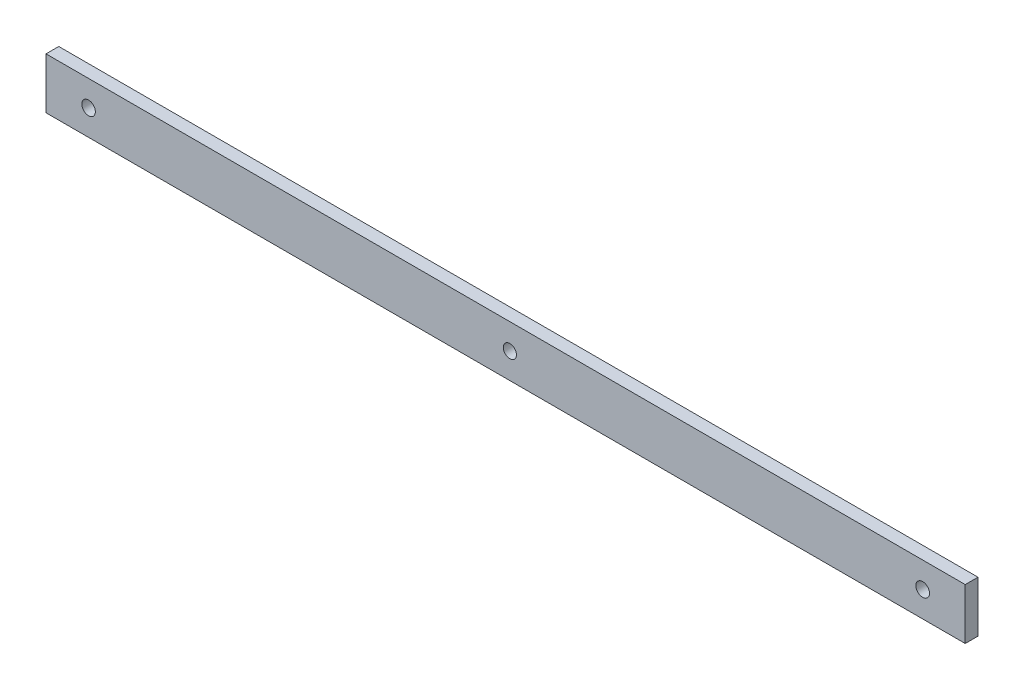
ISO-10303-21;
HEADER;
FILE_DESCRIPTION(('STEP AP214'),'2;1');
FILE_NAME('part.step','',(''),(''),'','','');
FILE_SCHEMA(('AUTOMOTIVE_DESIGN { 1 0 10303 214 1 1 1 1 }'));
ENDSEC;
DATA;
#1=APPLICATION_CONTEXT('core data for automotive mechanical design processes');
#2=APPLICATION_PROTOCOL_DEFINITION('international standard','automotive_design',2000,#1);
#3=PRODUCT_CONTEXT('',#1,'mechanical');
#4=PRODUCT('Part','Part','',(#3));
#5=PRODUCT_RELATED_PRODUCT_CATEGORY('part','',(#4));
#6=PRODUCT_DEFINITION_FORMATION('','',#4);
#7=PRODUCT_DEFINITION_CONTEXT('part definition',#1,'design');
#8=PRODUCT_DEFINITION('design','',#6,#7);
#9=PRODUCT_DEFINITION_SHAPE('','',#8);
#10=(LENGTH_UNIT() NAMED_UNIT(*) SI_UNIT(.MILLI.,.METRE.));
#11=(NAMED_UNIT(*) PLANE_ANGLE_UNIT() SI_UNIT($,.RADIAN.));
#12=(NAMED_UNIT(*) SI_UNIT($,.STERADIAN.) SOLID_ANGLE_UNIT());
#13=UNCERTAINTY_MEASURE_WITH_UNIT(LENGTH_MEASURE(1.E-05),#10,'distance_accuracy_value','');
#14=(GEOMETRIC_REPRESENTATION_CONTEXT(3) GLOBAL_UNCERTAINTY_ASSIGNED_CONTEXT((#13)) GLOBAL_UNIT_ASSIGNED_CONTEXT((#10,
#11,#12)) REPRESENTATION_CONTEXT('',''));
#15=CARTESIAN_POINT('',(0.,0.,0.));
#16=DIRECTION('',(0.,0.,1.));
#17=DIRECTION('',(1.,0.,0.));
#18=AXIS2_PLACEMENT_3D('',#15,#16,#17);
#19=CARTESIAN_POINT('',(0.,0.,3.));
#20=DIRECTION('',(0.,0.,-1.));
#21=DIRECTION('',(-1.,0.,0.));
#22=AXIS2_PLACEMENT_3D('',#19,#20,#21);
#23=PLANE('',#22);
#24=CARTESIAN_POINT('',(10.,6.,3.));
#25=DIRECTION('',(0.,0.,-1.));
#26=DIRECTION('',(-1.,0.,0.));
#27=AXIS2_PLACEMENT_3D('',#24,#25,#26);
#28=CIRCLE('',#27,1.6);
#29=CARTESIAN_POINT('',(8.4,6.,3.));
#30=VERTEX_POINT('',#29);
#31=EDGE_CURVE('E122',#30,#30,#28,.T.);
#32=ORIENTED_EDGE('',*,*,#31,.T.);
#33=EDGE_LOOP('',(#32));
#34=FACE_BOUND('',#33,.T.);
#35=CARTESIAN_POINT('',(109.,6.0000000000002,3.));
#36=DIRECTION('',(0.,0.,-1.));
#37=DIRECTION('',(-1.,0.,0.));
#38=AXIS2_PLACEMENT_3D('',#35,#36,#37);
#39=CIRCLE('',#38,1.54999999999999);
#40=CARTESIAN_POINT('',(107.45,6.0000000000002,3.));
#41=VERTEX_POINT('',#40);
#42=EDGE_CURVE('E116',#41,#41,#39,.T.);
#43=ORIENTED_EDGE('',*,*,#42,.T.);
#44=EDGE_LOOP('',(#43));
#45=FACE_BOUND('',#44,.T.);
#46=DIRECTION('',(0.,-1.,0.));
#47=VECTOR('',#46,1.);
#48=CARTESIAN_POINT('',(0.,0.,3.));
#49=LINE('',#48,#47);
#50=CARTESIAN_POINT('',(0.,12.,3.));
#51=VERTEX_POINT('',#50);
#52=CARTESIAN_POINT('',(0.,0.,3.));
#53=VERTEX_POINT('',#52);
#54=EDGE_CURVE('E86',#51,#53,#49,.T.);
#55=ORIENTED_EDGE('',*,*,#54,.T.);
#56=DIRECTION('',(1.,0.,0.));
#57=VECTOR('',#56,1.);
#58=CARTESIAN_POINT('',(0.,0.,3.));
#59=LINE('',#58,#57);
#60=CARTESIAN_POINT('',(216.,0.,3.));
#61=VERTEX_POINT('',#60);
#62=EDGE_CURVE('E81',#53,#61,#59,.T.);
#63=ORIENTED_EDGE('',*,*,#62,.T.);
#64=DIRECTION('',(0.,1.,0.));
#65=VECTOR('',#64,1.);
#66=CARTESIAN_POINT('',(216.,0.,3.));
#67=LINE('',#66,#65);
#68=CARTESIAN_POINT('',(216.,12.0000000000001,3.));
#69=VERTEX_POINT('',#68);
#70=EDGE_CURVE('E84',#61,#69,#67,.T.);
#71=ORIENTED_EDGE('',*,*,#70,.T.);
#72=DIRECTION('',(-1.,0.,0.));
#73=VECTOR('',#72,1.);
#74=CARTESIAN_POINT('',(0.,12.,3.));
#75=LINE('',#74,#73);
#76=EDGE_CURVE('E51',#69,#51,#75,.T.);
#77=ORIENTED_EDGE('',*,*,#76,.T.);
#78=EDGE_LOOP('',(#55,#63,#71,#77));
#79=FACE_BOUND('',#78,.T.);
#80=CARTESIAN_POINT('',(206.,6.00000000000002,3.));
#81=DIRECTION('',(0.,0.,1.));
#82=DIRECTION('',(1.,0.,0.));
#83=AXIS2_PLACEMENT_3D('',#80,#81,#82);
#84=CIRCLE('',#83,1.59999999999999);
#85=CARTESIAN_POINT('',(207.6,6.00000000000002,3.));
#86=VERTEX_POINT('',#85);
#87=EDGE_CURVE('E101',#86,#86,#84,.T.);
#88=ORIENTED_EDGE('',*,*,#87,.F.);
#89=EDGE_LOOP('',(#88));
#90=FACE_BOUND('',#89,.T.);
#91=ADVANCED_FACE('F34',(#34,#45,#79,#90),#23,.F.);
#92=CARTESIAN_POINT('',(0.,0.,0.));
#93=DIRECTION('',(0.,0.,-1.));
#94=DIRECTION('',(-1.,0.,0.));
#95=AXIS2_PLACEMENT_3D('',#92,#93,#94);
#96=PLANE('',#95);
#97=CARTESIAN_POINT('',(10.,6.,0.));
#98=DIRECTION('',(0.,0.,-1.));
#99=DIRECTION('',(-1.,0.,0.));
#100=AXIS2_PLACEMENT_3D('',#97,#98,#99);
#101=CIRCLE('',#100,1.6);
#102=CARTESIAN_POINT('',(8.4,6.,0.));
#103=VERTEX_POINT('',#102);
#104=EDGE_CURVE('E125',#103,#103,#101,.T.);
#105=ORIENTED_EDGE('',*,*,#104,.F.);
#106=EDGE_LOOP('',(#105));
#107=FACE_BOUND('',#106,.T.);
#108=CARTESIAN_POINT('',(109.,6.0000000000002,0.));
#109=DIRECTION('',(0.,0.,-1.));
#110=DIRECTION('',(-1.,0.,0.));
#111=AXIS2_PLACEMENT_3D('',#108,#109,#110);
#112=CIRCLE('',#111,1.54999999999999);
#113=CARTESIAN_POINT('',(107.45,6.0000000000002,0.));
#114=VERTEX_POINT('',#113);
#115=EDGE_CURVE('E119',#114,#114,#112,.T.);
#116=ORIENTED_EDGE('',*,*,#115,.F.);
#117=EDGE_LOOP('',(#116));
#118=FACE_BOUND('',#117,.T.);
#119=DIRECTION('',(0.,-1.,0.));
#120=VECTOR('',#119,1.);
#121=CARTESIAN_POINT('',(0.,0.,0.));
#122=LINE('',#121,#120);
#123=CARTESIAN_POINT('',(0.,12.,0.));
#124=VERTEX_POINT('',#123);
#125=CARTESIAN_POINT('',(0.,0.,0.));
#126=VERTEX_POINT('',#125);
#127=EDGE_CURVE('E98',#124,#126,#122,.T.);
#128=ORIENTED_EDGE('',*,*,#127,.F.);
#129=DIRECTION('',(-1.,0.,0.));
#130=VECTOR('',#129,1.);
#131=CARTESIAN_POINT('',(0.,12.,0.));
#132=LINE('',#131,#130);
#133=CARTESIAN_POINT('',(216.,12.0000000000001,0.));
#134=VERTEX_POINT('',#133);
#135=EDGE_CURVE('E74',#134,#124,#132,.T.);
#136=ORIENTED_EDGE('',*,*,#135,.F.);
#137=DIRECTION('',(0.,1.,0.));
#138=VECTOR('',#137,1.);
#139=CARTESIAN_POINT('',(216.,0.,0.));
#140=LINE('',#139,#138);
#141=CARTESIAN_POINT('',(216.,0.,0.));
#142=VERTEX_POINT('',#141);
#143=EDGE_CURVE('E68',#142,#134,#140,.T.);
#144=ORIENTED_EDGE('',*,*,#143,.F.);
#145=DIRECTION('',(1.,0.,0.));
#146=VECTOR('',#145,1.);
#147=CARTESIAN_POINT('',(0.,0.,0.));
#148=LINE('',#147,#146);
#149=EDGE_CURVE('E90',#126,#142,#148,.T.);
#150=ORIENTED_EDGE('',*,*,#149,.F.);
#151=EDGE_LOOP('',(#128,#136,#144,#150));
#152=FACE_BOUND('',#151,.T.);
#153=CARTESIAN_POINT('',(206.,6.00000000000002,0.));
#154=DIRECTION('',(0.,0.,1.));
#155=DIRECTION('',(1.,0.,0.));
#156=AXIS2_PLACEMENT_3D('',#153,#154,#155);
#157=CIRCLE('',#156,1.59999999999999);
#158=CARTESIAN_POINT('',(207.6,6.00000000000002,0.));
#159=VERTEX_POINT('',#158);
#160=EDGE_CURVE('E113',#159,#159,#157,.T.);
#161=ORIENTED_EDGE('',*,*,#160,.T.);
#162=EDGE_LOOP('',(#161));
#163=FACE_BOUND('',#162,.T.);
#164=ADVANCED_FACE('F109',(#107,#118,#152,#163),#96,.T.);
#165=CARTESIAN_POINT('',(0.,0.,3.));
#166=DIRECTION('',(1.,0.,0.));
#167=DIRECTION('',(0.,1.,0.));
#168=AXIS2_PLACEMENT_3D('',#165,#166,#167);
#169=PLANE('',#168);
#170=ORIENTED_EDGE('',*,*,#127,.T.);
#171=DIRECTION('',(0.,0.,-1.));
#172=VECTOR('',#171,1.);
#173=CARTESIAN_POINT('',(0.,0.,3.));
#174=LINE('',#173,#172);
#175=EDGE_CURVE('E11',#53,#126,#174,.T.);
#176=ORIENTED_EDGE('',*,*,#175,.F.);
#177=ORIENTED_EDGE('',*,*,#54,.F.);
#178=DIRECTION('',(0.,0.,-1.));
#179=VECTOR('',#178,1.);
#180=CARTESIAN_POINT('',(0.,12.,3.));
#181=LINE('',#180,#179);
#182=EDGE_CURVE('E94',#51,#124,#181,.T.);
#183=ORIENTED_EDGE('',*,*,#182,.T.);
#184=EDGE_LOOP('',(#170,#176,#177,#183));
#185=FACE_BOUND('',#184,.T.);
#186=ADVANCED_FACE('F36',(#185),#169,.F.);
#187=CARTESIAN_POINT('',(0.,0.,3.));
#188=DIRECTION('',(0.,1.,0.));
#189=DIRECTION('',(0.,0.,1.));
#190=AXIS2_PLACEMENT_3D('',#187,#188,#189);
#191=PLANE('',#190);
#192=ORIENTED_EDGE('',*,*,#149,.T.);
#193=DIRECTION('',(0.,0.,-1.));
#194=VECTOR('',#193,1.);
#195=CARTESIAN_POINT('',(216.,0.,3.));
#196=LINE('',#195,#194);
#197=EDGE_CURVE('E43',#61,#142,#196,.T.);
#198=ORIENTED_EDGE('',*,*,#197,.F.);
#199=ORIENTED_EDGE('',*,*,#62,.F.);
#200=ORIENTED_EDGE('',*,*,#175,.T.);
#201=EDGE_LOOP('',(#192,#198,#199,#200));
#202=FACE_BOUND('',#201,.T.);
#203=ADVANCED_FACE('F89',(#202),#191,.F.);
#204=CARTESIAN_POINT('',(216.,0.,3.));
#205=DIRECTION('',(-1.,0.,0.));
#206=DIRECTION('',(0.,0.,1.));
#207=AXIS2_PLACEMENT_3D('',#204,#205,#206);
#208=PLANE('',#207);
#209=ORIENTED_EDGE('',*,*,#143,.T.);
#210=DIRECTION('',(0.,0.,-1.));
#211=VECTOR('',#210,1.);
#212=CARTESIAN_POINT('',(216.,12.0000000000001,3.));
#213=LINE('',#212,#211);
#214=EDGE_CURVE('E91',#69,#134,#213,.T.);
#215=ORIENTED_EDGE('',*,*,#214,.F.);
#216=ORIENTED_EDGE('',*,*,#70,.F.);
#217=ORIENTED_EDGE('',*,*,#197,.T.);
#218=EDGE_LOOP('',(#209,#215,#216,#217));
#219=FACE_BOUND('',#218,.T.);
#220=ADVANCED_FACE('F92',(#219),#208,.F.);
#221=CARTESIAN_POINT('',(0.,12.,3.));
#222=DIRECTION('',(0.,-1.,0.));
#223=DIRECTION('',(1.,0.,0.));
#224=AXIS2_PLACEMENT_3D('',#221,#222,#223);
#225=PLANE('',#224);
#226=ORIENTED_EDGE('',*,*,#135,.T.);
#227=ORIENTED_EDGE('',*,*,#182,.F.);
#228=ORIENTED_EDGE('',*,*,#76,.F.);
#229=ORIENTED_EDGE('',*,*,#214,.T.);
#230=EDGE_LOOP('',(#226,#227,#228,#229));
#231=FACE_BOUND('',#230,.T.);
#232=ADVANCED_FACE('F106',(#231),#225,.F.);
#233=CARTESIAN_POINT('',(206.,6.00000000000002,3.));
#234=DIRECTION('',(0.,0.,-1.));
#235=DIRECTION('',(-1.,0.,0.));
#236=AXIS2_PLACEMENT_3D('',#233,#234,#235);
#237=CYLINDRICAL_SURFACE('',#236,1.59999999999999);
#238=ORIENTED_EDGE('',*,*,#87,.T.);
#239=EDGE_LOOP('',(#238));
#240=FACE_BOUND('',#239,.T.);
#241=ORIENTED_EDGE('',*,*,#160,.F.);
#242=EDGE_LOOP('',(#241));
#243=FACE_BOUND('',#242,.T.);
#244=ADVANCED_FACE('F146',(#240,#243),#237,.F.);
#245=CARTESIAN_POINT('',(109.,6.0000000000002,3.));
#246=DIRECTION('',(0.,0.,-1.));
#247=DIRECTION('',(-1.,0.,0.));
#248=AXIS2_PLACEMENT_3D('',#245,#246,#247);
#249=CYLINDRICAL_SURFACE('',#248,1.54999999999999);
#250=ORIENTED_EDGE('',*,*,#42,.F.);
#251=EDGE_LOOP('',(#250));
#252=FACE_BOUND('',#251,.T.);
#253=ORIENTED_EDGE('',*,*,#115,.T.);
#254=EDGE_LOOP('',(#253));
#255=FACE_BOUND('',#254,.T.);
#256=ADVANCED_FACE('F136',(#252,#255),#249,.F.);
#257=CARTESIAN_POINT('',(10.,6.,3.));
#258=DIRECTION('',(0.,0.,-1.));
#259=DIRECTION('',(-1.,0.,0.));
#260=AXIS2_PLACEMENT_3D('',#257,#258,#259);
#261=CYLINDRICAL_SURFACE('',#260,1.6);
#262=ORIENTED_EDGE('',*,*,#31,.F.);
#263=EDGE_LOOP('',(#262));
#264=FACE_BOUND('',#263,.T.);
#265=ORIENTED_EDGE('',*,*,#104,.T.);
#266=EDGE_LOOP('',(#265));
#267=FACE_BOUND('',#266,.T.);
#268=ADVANCED_FACE('F133',(#264,#267),#261,.F.);
#269=CLOSED_SHELL('',(#91,#164,#186,#203,#220,#232,#244,#256,#268));
#270=MANIFOLD_SOLID_BREP('B2',#269);
#271=ADVANCED_BREP_SHAPE_REPRESENTATION('',(#18,#270),#14);
#272=SHAPE_DEFINITION_REPRESENTATION(#9,#271);
ENDSEC;
END-ISO-10303-21;
